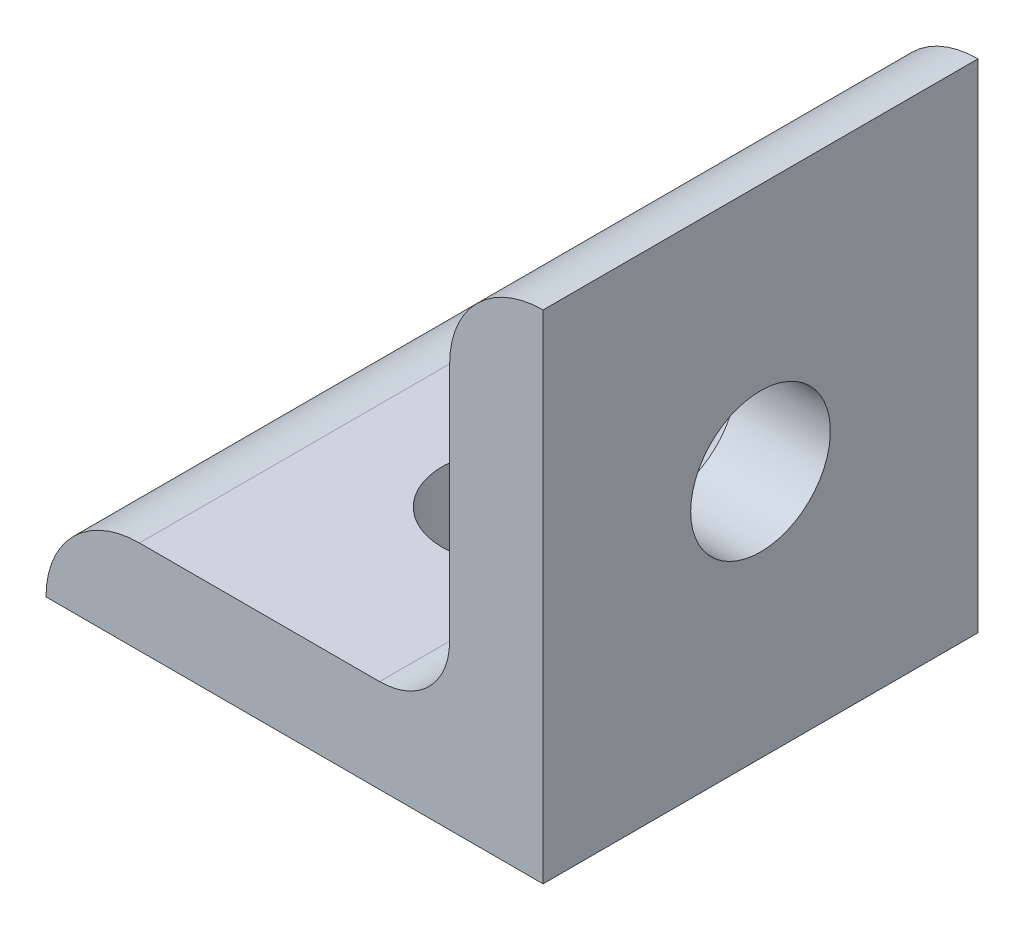
ISO-10303-21;
HEADER;
FILE_DESCRIPTION(('STEP AP214'),'2;1');
FILE_NAME('part.step','',(''),(''),'','','');
FILE_SCHEMA(('AUTOMOTIVE_DESIGN { 1 0 10303 214 1 1 1 1 }'));
ENDSEC;
DATA;
#1=APPLICATION_CONTEXT('core data for automotive mechanical design processes');
#2=APPLICATION_PROTOCOL_DEFINITION('international standard','automotive_design',2000,#1);
#3=PRODUCT_CONTEXT('',#1,'mechanical');
#4=PRODUCT('Part','Part','',(#3));
#5=PRODUCT_RELATED_PRODUCT_CATEGORY('part','',(#4));
#6=PRODUCT_DEFINITION_FORMATION('','',#4);
#7=PRODUCT_DEFINITION_CONTEXT('part definition',#1,'design');
#8=PRODUCT_DEFINITION('design','',#6,#7);
#9=PRODUCT_DEFINITION_SHAPE('','',#8);
#10=(LENGTH_UNIT() NAMED_UNIT(*) SI_UNIT(.MILLI.,.METRE.));
#11=(NAMED_UNIT(*) PLANE_ANGLE_UNIT() SI_UNIT($,.RADIAN.));
#12=(NAMED_UNIT(*) SI_UNIT($,.STERADIAN.) SOLID_ANGLE_UNIT());
#13=UNCERTAINTY_MEASURE_WITH_UNIT(LENGTH_MEASURE(1.E-05),#10,'distance_accuracy_value','');
#14=(GEOMETRIC_REPRESENTATION_CONTEXT(3) GLOBAL_UNCERTAINTY_ASSIGNED_CONTEXT((#13)) GLOBAL_UNIT_ASSIGNED_CONTEXT((#10,
#11,#12)) REPRESENTATION_CONTEXT('',''));
#15=CARTESIAN_POINT('',(0.,0.,0.));
#16=DIRECTION('',(0.,0.,1.));
#17=DIRECTION('',(1.,0.,0.));
#18=AXIS2_PLACEMENT_3D('',#15,#16,#17);
#19=CARTESIAN_POINT('',(0.,0.,-11.1125));
#20=DIRECTION('',(0.,-1.,0.));
#21=DIRECTION('',(1.,0.,0.));
#22=AXIS2_PLACEMENT_3D('',#19,#20,#21);
#23=PLANE('',#22);
#24=CARTESIAN_POINT('',(-12.7,0.,0.));
#25=DIRECTION('',(0.,1.,0.));
#26=DIRECTION('',(0.,0.,1.));
#27=AXIS2_PLACEMENT_3D('',#24,#25,#26);
#28=CIRCLE('',#27,3.5687);
#29=CARTESIAN_POINT('',(-12.7,0.,3.5687));
#30=VERTEX_POINT('',#29);
#31=EDGE_CURVE('E125',#30,#30,#28,.T.);
#32=ORIENTED_EDGE('',*,*,#31,.T.);
#33=EDGE_LOOP('',(#32));
#34=FACE_BOUND('',#33,.T.);
#35=DIRECTION('',(1.,0.,0.));
#36=VECTOR('',#35,1.);
#37=CARTESIAN_POINT('',(0.,0.,11.1125));
#38=LINE('',#37,#36);
#39=CARTESIAN_POINT('',(-25.4,0.,11.1125));
#40=VERTEX_POINT('',#39);
#41=CARTESIAN_POINT('',(0.,0.,11.1125));
#42=VERTEX_POINT('',#41);
#43=EDGE_CURVE('E121',#40,#42,#38,.T.);
#44=ORIENTED_EDGE('',*,*,#43,.F.);
#45=DIRECTION('',(0.,0.,1.));
#46=VECTOR('',#45,1.);
#47=CARTESIAN_POINT('',(-25.4,0.,-11.1125));
#48=LINE('',#47,#46);
#49=CARTESIAN_POINT('',(-25.4,0.,-11.1125));
#50=VERTEX_POINT('',#49);
#51=EDGE_CURVE('E11',#50,#40,#48,.T.);
#52=ORIENTED_EDGE('',*,*,#51,.F.);
#53=DIRECTION('',(1.,0.,0.));
#54=VECTOR('',#53,1.);
#55=CARTESIAN_POINT('',(0.,0.,-11.1125));
#56=LINE('',#55,#54);
#57=CARTESIAN_POINT('',(0.,0.,-11.1125));
#58=VERTEX_POINT('',#57);
#59=EDGE_CURVE('E139',#50,#58,#56,.T.);
#60=ORIENTED_EDGE('',*,*,#59,.T.);
#61=DIRECTION('',(0.,0.,1.));
#62=VECTOR('',#61,1.);
#63=CARTESIAN_POINT('',(0.,0.,-11.1125));
#64=LINE('',#63,#62);
#65=EDGE_CURVE('E33',#58,#42,#64,.T.);
#66=ORIENTED_EDGE('',*,*,#65,.T.);
#67=EDGE_LOOP('',(#44,#52,#60,#66));
#68=FACE_BOUND('',#67,.T.);
#69=ADVANCED_FACE('F30',(#34,#68),#23,.T.);
#70=CARTESIAN_POINT('',(-20.6248,0.,-11.1125));
#71=DIRECTION('',(0.,0.,1.));
#72=DIRECTION('',(1.,0.,0.));
#73=AXIS2_PLACEMENT_3D('',#70,#71,#72);
#74=CYLINDRICAL_SURFACE('',#73,4.7752);
#75=CARTESIAN_POINT('',(-20.6248,0.,11.1125));
#76=DIRECTION('',(0.,0.,1.));
#77=DIRECTION('',(-1.,0.,0.));
#78=AXIS2_PLACEMENT_3D('',#75,#76,#77);
#79=CIRCLE('',#78,4.7752);
#80=CARTESIAN_POINT('',(-20.6248,4.7752,11.1125));
#81=VERTEX_POINT('',#80);
#82=EDGE_CURVE('E137',#81,#40,#79,.T.);
#83=ORIENTED_EDGE('',*,*,#82,.F.);
#84=DIRECTION('',(0.,0.,1.));
#85=VECTOR('',#84,1.);
#86=CARTESIAN_POINT('',(-20.6248,4.7752,-11.1125));
#87=LINE('',#86,#85);
#88=CARTESIAN_POINT('',(-20.6248,4.7752,-11.1125));
#89=VERTEX_POINT('',#88);
#90=EDGE_CURVE('E39',#89,#81,#87,.T.);
#91=ORIENTED_EDGE('',*,*,#90,.F.);
#92=CARTESIAN_POINT('',(-20.6248,0.,-11.1125));
#93=DIRECTION('',(0.,0.,1.));
#94=DIRECTION('',(-1.,0.,0.));
#95=AXIS2_PLACEMENT_3D('',#92,#93,#94);
#96=CIRCLE('',#95,4.7752);
#97=EDGE_CURVE('E111',#89,#50,#96,.T.);
#98=ORIENTED_EDGE('',*,*,#97,.T.);
#99=ORIENTED_EDGE('',*,*,#51,.T.);
#100=EDGE_LOOP('',(#83,#91,#98,#99));
#101=FACE_BOUND('',#100,.T.);
#102=ADVANCED_FACE('F149',(#101),#74,.T.);
#103=CARTESIAN_POINT('',(-20.6248,4.7752,-11.1125));
#104=DIRECTION('',(0.,1.,0.));
#105=DIRECTION('',(-1.,0.,0.));
#106=AXIS2_PLACEMENT_3D('',#103,#104,#105);
#107=PLANE('',#106);
#108=CARTESIAN_POINT('',(-12.7,4.77519999999999,0.));
#109=DIRECTION('',(0.,1.,0.));
#110=DIRECTION('',(0.,0.,1.));
#111=AXIS2_PLACEMENT_3D('',#108,#109,#110);
#112=CIRCLE('',#111,3.5687);
#113=CARTESIAN_POINT('',(-12.7,4.77519999999999,3.5687));
#114=VERTEX_POINT('',#113);
#115=EDGE_CURVE('E180',#114,#114,#112,.T.);
#116=ORIENTED_EDGE('',*,*,#115,.F.);
#117=EDGE_LOOP('',(#116));
#118=FACE_BOUND('',#117,.T.);
#119=DIRECTION('',(-1.,0.,0.));
#120=VECTOR('',#119,1.);
#121=CARTESIAN_POINT('',(-20.6248,4.7752,11.1125));
#122=LINE('',#121,#120);
#123=CARTESIAN_POINT('',(-8.3566,4.7752,11.1125));
#124=VERTEX_POINT('',#123);
#125=EDGE_CURVE('E98',#124,#81,#122,.T.);
#126=ORIENTED_EDGE('',*,*,#125,.F.);
#127=DIRECTION('',(0.,0.,1.));
#128=VECTOR('',#127,1.);
#129=CARTESIAN_POINT('',(-8.3566,4.7752,-11.1125));
#130=LINE('',#129,#128);
#131=CARTESIAN_POINT('',(-8.3566,4.7752,-11.1125));
#132=VERTEX_POINT('',#131);
#133=EDGE_CURVE('E93',#132,#124,#130,.T.);
#134=ORIENTED_EDGE('',*,*,#133,.F.);
#135=DIRECTION('',(-1.,0.,0.));
#136=VECTOR('',#135,1.);
#137=CARTESIAN_POINT('',(-20.6248,4.7752,-11.1125));
#138=LINE('',#137,#136);
#139=EDGE_CURVE('E96',#132,#89,#138,.T.);
#140=ORIENTED_EDGE('',*,*,#139,.T.);
#141=ORIENTED_EDGE('',*,*,#90,.T.);
#142=EDGE_LOOP('',(#126,#134,#140,#141));
#143=FACE_BOUND('',#142,.T.);
#144=ADVANCED_FACE('F95',(#118,#143),#107,.T.);
#145=CARTESIAN_POINT('',(-8.3566,8.35659999999999,-11.1125));
#146=DIRECTION('',(0.,0.,1.));
#147=DIRECTION('',(1.,0.,0.));
#148=AXIS2_PLACEMENT_3D('',#145,#146,#147);
#149=CYLINDRICAL_SURFACE('',#148,3.5814);
#150=CARTESIAN_POINT('',(-8.3566,8.35659999999999,11.1125));
#151=DIRECTION('',(0.,0.,-1.));
#152=DIRECTION('',(1.,0.,0.));
#153=AXIS2_PLACEMENT_3D('',#150,#151,#152);
#154=CIRCLE('',#153,3.5814);
#155=CARTESIAN_POINT('',(-4.7752,8.35659999999999,11.1125));
#156=VERTEX_POINT('',#155);
#157=EDGE_CURVE('E134',#156,#124,#154,.T.);
#158=ORIENTED_EDGE('',*,*,#157,.F.);
#159=DIRECTION('',(0.,0.,1.));
#160=VECTOR('',#159,1.);
#161=CARTESIAN_POINT('',(-4.7752,8.35659999999999,-11.1125));
#162=LINE('',#161,#160);
#163=CARTESIAN_POINT('',(-4.7752,8.35659999999999,-11.1125));
#164=VERTEX_POINT('',#163);
#165=EDGE_CURVE('E103',#164,#156,#162,.T.);
#166=ORIENTED_EDGE('',*,*,#165,.F.);
#167=CARTESIAN_POINT('',(-8.3566,8.35659999999999,-11.1125));
#168=DIRECTION('',(0.,0.,-1.));
#169=DIRECTION('',(1.,0.,0.));
#170=AXIS2_PLACEMENT_3D('',#167,#168,#169);
#171=CIRCLE('',#170,3.5814);
#172=EDGE_CURVE('E109',#164,#132,#171,.T.);
#173=ORIENTED_EDGE('',*,*,#172,.T.);
#174=ORIENTED_EDGE('',*,*,#133,.T.);
#175=EDGE_LOOP('',(#158,#166,#173,#174));
#176=FACE_BOUND('',#175,.T.);
#177=ADVANCED_FACE('F113',(#176),#149,.F.);
#178=CARTESIAN_POINT('',(-4.7752,8.35659999999999,-11.1125));
#179=DIRECTION('',(-1.,0.,0.));
#180=DIRECTION('',(0.,0.,1.));
#181=AXIS2_PLACEMENT_3D('',#178,#179,#180);
#182=PLANE('',#181);
#183=CARTESIAN_POINT('',(-4.7752,12.7,0.));
#184=DIRECTION('',(-1.,0.,0.));
#185=DIRECTION('',(0.,0.,1.));
#186=AXIS2_PLACEMENT_3D('',#183,#184,#185);
#187=CIRCLE('',#186,3.5687);
#188=CARTESIAN_POINT('',(-4.7752,12.7,3.5687));
#189=VERTEX_POINT('',#188);
#190=EDGE_CURVE('E181',#189,#189,#187,.T.);
#191=ORIENTED_EDGE('',*,*,#190,.F.);
#192=EDGE_LOOP('',(#191));
#193=FACE_BOUND('',#192,.T.);
#194=DIRECTION('',(0.,-1.,0.));
#195=VECTOR('',#194,1.);
#196=CARTESIAN_POINT('',(-4.7752,8.35659999999999,11.1125));
#197=LINE('',#196,#195);
#198=CARTESIAN_POINT('',(-4.7752,20.6248,11.1125));
#199=VERTEX_POINT('',#198);
#200=EDGE_CURVE('E131',#199,#156,#197,.T.);
#201=ORIENTED_EDGE('',*,*,#200,.F.);
#202=DIRECTION('',(0.,0.,1.));
#203=VECTOR('',#202,1.);
#204=CARTESIAN_POINT('',(-4.7752,20.6248,-11.1125));
#205=LINE('',#204,#203);
#206=CARTESIAN_POINT('',(-4.7752,20.6248,-11.1125));
#207=VERTEX_POINT('',#206);
#208=EDGE_CURVE('E143',#207,#199,#205,.T.);
#209=ORIENTED_EDGE('',*,*,#208,.F.);
#210=DIRECTION('',(0.,-1.,0.));
#211=VECTOR('',#210,1.);
#212=CARTESIAN_POINT('',(-4.7752,8.35659999999999,-11.1125));
#213=LINE('',#212,#211);
#214=EDGE_CURVE('E114',#207,#164,#213,.T.);
#215=ORIENTED_EDGE('',*,*,#214,.T.);
#216=ORIENTED_EDGE('',*,*,#165,.T.);
#217=EDGE_LOOP('',(#201,#209,#215,#216));
#218=FACE_BOUND('',#217,.T.);
#219=ADVANCED_FACE('F164',(#193,#218),#182,.T.);
#220=CARTESIAN_POINT('',(0.,20.6248,-11.1125));
#221=DIRECTION('',(0.,0.,1.));
#222=DIRECTION('',(1.,0.,0.));
#223=AXIS2_PLACEMENT_3D('',#220,#221,#222);
#224=CYLINDRICAL_SURFACE('',#223,4.7752);
#225=CARTESIAN_POINT('',(0.,20.6248,11.1125));
#226=DIRECTION('',(0.,0.,1.));
#227=DIRECTION('',(-1.,0.,0.));
#228=AXIS2_PLACEMENT_3D('',#225,#226,#227);
#229=CIRCLE('',#228,4.7752);
#230=CARTESIAN_POINT('',(0.,25.4,11.1125));
#231=VERTEX_POINT('',#230);
#232=EDGE_CURVE('E128',#231,#199,#229,.T.);
#233=ORIENTED_EDGE('',*,*,#232,.F.);
#234=DIRECTION('',(0.,0.,1.));
#235=VECTOR('',#234,1.);
#236=CARTESIAN_POINT('',(0.,25.4,-11.1125));
#237=LINE('',#236,#235);
#238=CARTESIAN_POINT('',(0.,25.4,-11.1125));
#239=VERTEX_POINT('',#238);
#240=EDGE_CURVE('E144',#239,#231,#237,.T.);
#241=ORIENTED_EDGE('',*,*,#240,.F.);
#242=CARTESIAN_POINT('',(0.,20.6248,-11.1125));
#243=DIRECTION('',(0.,0.,1.));
#244=DIRECTION('',(-1.,0.,0.));
#245=AXIS2_PLACEMENT_3D('',#242,#243,#244);
#246=CIRCLE('',#245,4.7752);
#247=EDGE_CURVE('E116',#239,#207,#246,.T.);
#248=ORIENTED_EDGE('',*,*,#247,.T.);
#249=ORIENTED_EDGE('',*,*,#208,.T.);
#250=EDGE_LOOP('',(#233,#241,#248,#249));
#251=FACE_BOUND('',#250,.T.);
#252=ADVANCED_FACE('F167',(#251),#224,.T.);
#253=CARTESIAN_POINT('',(0.,0.,-11.1125));
#254=DIRECTION('',(1.,0.,0.));
#255=DIRECTION('',(0.,0.,-1.));
#256=AXIS2_PLACEMENT_3D('',#253,#254,#255);
#257=PLANE('',#256);
#258=CARTESIAN_POINT('',(0.,12.7,0.));
#259=DIRECTION('',(-1.,0.,0.));
#260=DIRECTION('',(0.,0.,1.));
#261=AXIS2_PLACEMENT_3D('',#258,#259,#260);
#262=CIRCLE('',#261,3.5687);
#263=CARTESIAN_POINT('',(0.,12.7,3.5687));
#264=VERTEX_POINT('',#263);
#265=EDGE_CURVE('E178',#264,#264,#262,.T.);
#266=ORIENTED_EDGE('',*,*,#265,.T.);
#267=EDGE_LOOP('',(#266));
#268=FACE_BOUND('',#267,.T.);
#269=DIRECTION('',(0.,1.,0.));
#270=VECTOR('',#269,1.);
#271=CARTESIAN_POINT('',(0.,0.,11.1125));
#272=LINE('',#271,#270);
#273=EDGE_CURVE('E124',#42,#231,#272,.T.);
#274=ORIENTED_EDGE('',*,*,#273,.F.);
#275=ORIENTED_EDGE('',*,*,#65,.F.);
#276=DIRECTION('',(0.,1.,0.));
#277=VECTOR('',#276,1.);
#278=CARTESIAN_POINT('',(0.,0.,-11.1125));
#279=LINE('',#278,#277);
#280=EDGE_CURVE('E191',#58,#239,#279,.T.);
#281=ORIENTED_EDGE('',*,*,#280,.T.);
#282=ORIENTED_EDGE('',*,*,#240,.T.);
#283=EDGE_LOOP('',(#274,#275,#281,#282));
#284=FACE_BOUND('',#283,.T.);
#285=ADVANCED_FACE('F146',(#268,#284),#257,.T.);
#286=CARTESIAN_POINT('',(-20.6248,0.,-11.1125));
#287=DIRECTION('',(0.,0.,-1.));
#288=DIRECTION('',(-1.,0.,0.));
#289=AXIS2_PLACEMENT_3D('',#286,#287,#288);
#290=PLANE('',#289);
#291=ORIENTED_EDGE('',*,*,#59,.F.);
#292=ORIENTED_EDGE('',*,*,#97,.F.);
#293=ORIENTED_EDGE('',*,*,#139,.F.);
#294=ORIENTED_EDGE('',*,*,#172,.F.);
#295=ORIENTED_EDGE('',*,*,#214,.F.);
#296=ORIENTED_EDGE('',*,*,#247,.F.);
#297=ORIENTED_EDGE('',*,*,#280,.F.);
#298=EDGE_LOOP('',(#291,#292,#293,#294,#295,#296,#297));
#299=FACE_BOUND('',#298,.T.);
#300=ADVANCED_FACE('F107',(#299),#290,.T.);
#301=CARTESIAN_POINT('',(-20.6248,0.,11.1125));
#302=DIRECTION('',(0.,0.,-1.));
#303=DIRECTION('',(-1.,0.,0.));
#304=AXIS2_PLACEMENT_3D('',#301,#302,#303);
#305=PLANE('',#304);
#306=ORIENTED_EDGE('',*,*,#43,.T.);
#307=ORIENTED_EDGE('',*,*,#273,.T.);
#308=ORIENTED_EDGE('',*,*,#232,.T.);
#309=ORIENTED_EDGE('',*,*,#200,.T.);
#310=ORIENTED_EDGE('',*,*,#157,.T.);
#311=ORIENTED_EDGE('',*,*,#125,.T.);
#312=ORIENTED_EDGE('',*,*,#82,.T.);
#313=EDGE_LOOP('',(#306,#307,#308,#309,#310,#311,#312));
#314=FACE_BOUND('',#313,.T.);
#315=ADVANCED_FACE('F148',(#314),#305,.F.);
#316=CARTESIAN_POINT('',(-12.7,0.,0.));
#317=DIRECTION('',(0.,1.,0.));
#318=DIRECTION('',(0.,0.,1.));
#319=AXIS2_PLACEMENT_3D('',#316,#317,#318);
#320=CYLINDRICAL_SURFACE('',#319,3.5687);
#321=ORIENTED_EDGE('',*,*,#31,.F.);
#322=EDGE_LOOP('',(#321));
#323=FACE_BOUND('',#322,.T.);
#324=ORIENTED_EDGE('',*,*,#115,.T.);
#325=EDGE_LOOP('',(#324));
#326=FACE_BOUND('',#325,.T.);
#327=ADVANCED_FACE('F198',(#323,#326),#320,.F.);
#328=CARTESIAN_POINT('',(0.,12.7,0.));
#329=DIRECTION('',(-1.,0.,0.));
#330=DIRECTION('',(0.,0.,1.));
#331=AXIS2_PLACEMENT_3D('',#328,#329,#330);
#332=CYLINDRICAL_SURFACE('',#331,3.5687);
#333=ORIENTED_EDGE('',*,*,#265,.F.);
#334=EDGE_LOOP('',(#333));
#335=FACE_BOUND('',#334,.T.);
#336=ORIENTED_EDGE('',*,*,#190,.T.);
#337=EDGE_LOOP('',(#336));
#338=FACE_BOUND('',#337,.T.);
#339=ADVANCED_FACE('F201',(#335,#338),#332,.F.);
#340=CLOSED_SHELL('',(#69,#102,#144,#177,#219,#252,#285,#300,#315,#327,#339));
#341=MANIFOLD_SOLID_BREP('B2',#340);
#342=ADVANCED_BREP_SHAPE_REPRESENTATION('',(#18,#341),#14);
#343=SHAPE_DEFINITION_REPRESENTATION(#9,#342);
ENDSEC;
END-ISO-10303-21;
